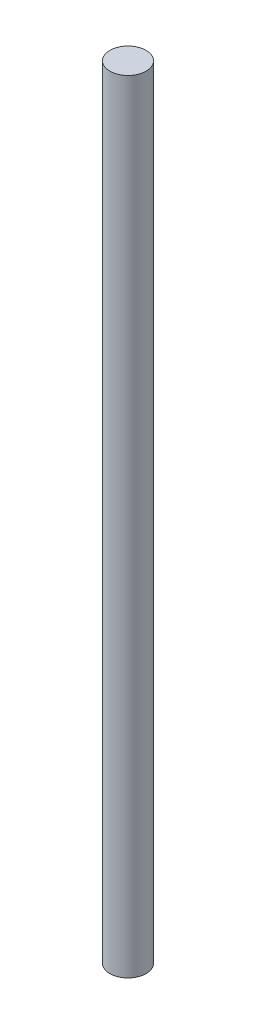
ISO-10303-21;
HEADER;
FILE_DESCRIPTION(('STEP AP214'),'2;1');
FILE_NAME('part.step','',(''),(''),'','','');
FILE_SCHEMA(('AUTOMOTIVE_DESIGN { 1 0 10303 214 1 1 1 1 }'));
ENDSEC;
DATA;
#1=APPLICATION_CONTEXT('core data for automotive mechanical design processes');
#2=APPLICATION_PROTOCOL_DEFINITION('international standard','automotive_design',2000,#1);
#3=PRODUCT_CONTEXT('',#1,'mechanical');
#4=PRODUCT('Part','Part','',(#3));
#5=PRODUCT_RELATED_PRODUCT_CATEGORY('part','',(#4));
#6=PRODUCT_DEFINITION_FORMATION('','',#4);
#7=PRODUCT_DEFINITION_CONTEXT('part definition',#1,'design');
#8=PRODUCT_DEFINITION('design','',#6,#7);
#9=PRODUCT_DEFINITION_SHAPE('','',#8);
#10=(LENGTH_UNIT() NAMED_UNIT(*) SI_UNIT(.MILLI.,.METRE.));
#11=(NAMED_UNIT(*) PLANE_ANGLE_UNIT() SI_UNIT($,.RADIAN.));
#12=(NAMED_UNIT(*) SI_UNIT($,.STERADIAN.) SOLID_ANGLE_UNIT());
#13=UNCERTAINTY_MEASURE_WITH_UNIT(LENGTH_MEASURE(1.E-05),#10,'distance_accuracy_value','');
#14=(GEOMETRIC_REPRESENTATION_CONTEXT(3) GLOBAL_UNCERTAINTY_ASSIGNED_CONTEXT((#13)) GLOBAL_UNIT_ASSIGNED_CONTEXT((#10,
#11,#12)) REPRESENTATION_CONTEXT('',''));
#15=CARTESIAN_POINT('',(0.,0.,0.));
#16=DIRECTION('',(0.,0.,1.));
#17=DIRECTION('',(1.,0.,0.));
#18=AXIS2_PLACEMENT_3D('',#15,#16,#17);
#19=CARTESIAN_POINT('',(0.,79.,0.));
#20=DIRECTION('',(0.,-1.,0.));
#21=DIRECTION('',(0.,0.,-1.));
#22=AXIS2_PLACEMENT_3D('',#19,#20,#21);
#23=CYLINDRICAL_SURFACE('',#22,1.825);
#24=CARTESIAN_POINT('',(0.,79.,0.));
#25=DIRECTION('',(0.,1.,0.));
#26=DIRECTION('',(0.,0.,1.));
#27=AXIS2_PLACEMENT_3D('',#24,#25,#26);
#28=CIRCLE('',#27,1.825);
#29=CARTESIAN_POINT('',(0.,79.,1.825));
#30=VERTEX_POINT('',#29);
#31=EDGE_CURVE('E10',#30,#30,#28,.T.);
#32=ORIENTED_EDGE('',*,*,#31,.F.);
#33=EDGE_LOOP('',(#32));
#34=FACE_BOUND('',#33,.T.);
#35=CARTESIAN_POINT('',(0.,0.,0.));
#36=DIRECTION('',(0.,1.,0.));
#37=DIRECTION('',(0.,0.,1.));
#38=AXIS2_PLACEMENT_3D('',#35,#36,#37);
#39=CIRCLE('',#38,1.825);
#40=CARTESIAN_POINT('',(0.,0.,1.825));
#41=VERTEX_POINT('',#40);
#42=EDGE_CURVE('E46',#41,#41,#39,.T.);
#43=ORIENTED_EDGE('',*,*,#42,.T.);
#44=EDGE_LOOP('',(#43));
#45=FACE_BOUND('',#44,.T.);
#46=ADVANCED_FACE('F43',(#34,#45),#23,.T.);
#47=CARTESIAN_POINT('',(0.,79.,0.));
#48=DIRECTION('',(0.,1.,0.));
#49=DIRECTION('',(0.,0.,1.));
#50=AXIS2_PLACEMENT_3D('',#47,#48,#49);
#51=PLANE('',#50);
#52=ORIENTED_EDGE('',*,*,#31,.T.);
#53=EDGE_LOOP('',(#52));
#54=FACE_BOUND('',#53,.T.);
#55=ADVANCED_FACE('F60',(#54),#51,.T.);
#56=CARTESIAN_POINT('',(0.,0.,0.));
#57=DIRECTION('',(0.,1.,0.));
#58=DIRECTION('',(0.,0.,1.));
#59=AXIS2_PLACEMENT_3D('',#56,#57,#58);
#60=PLANE('',#59);
#61=ORIENTED_EDGE('',*,*,#42,.F.);
#62=EDGE_LOOP('',(#61));
#63=FACE_BOUND('',#62,.T.);
#64=ADVANCED_FACE('F58',(#63),#60,.F.);
#65=CLOSED_SHELL('',(#46,#55,#64));
#66=MANIFOLD_SOLID_BREP('B2',#65);
#67=ADVANCED_BREP_SHAPE_REPRESENTATION('',(#18,#66),#14);
#68=SHAPE_DEFINITION_REPRESENTATION(#9,#67);
ENDSEC;
END-ISO-10303-21;
